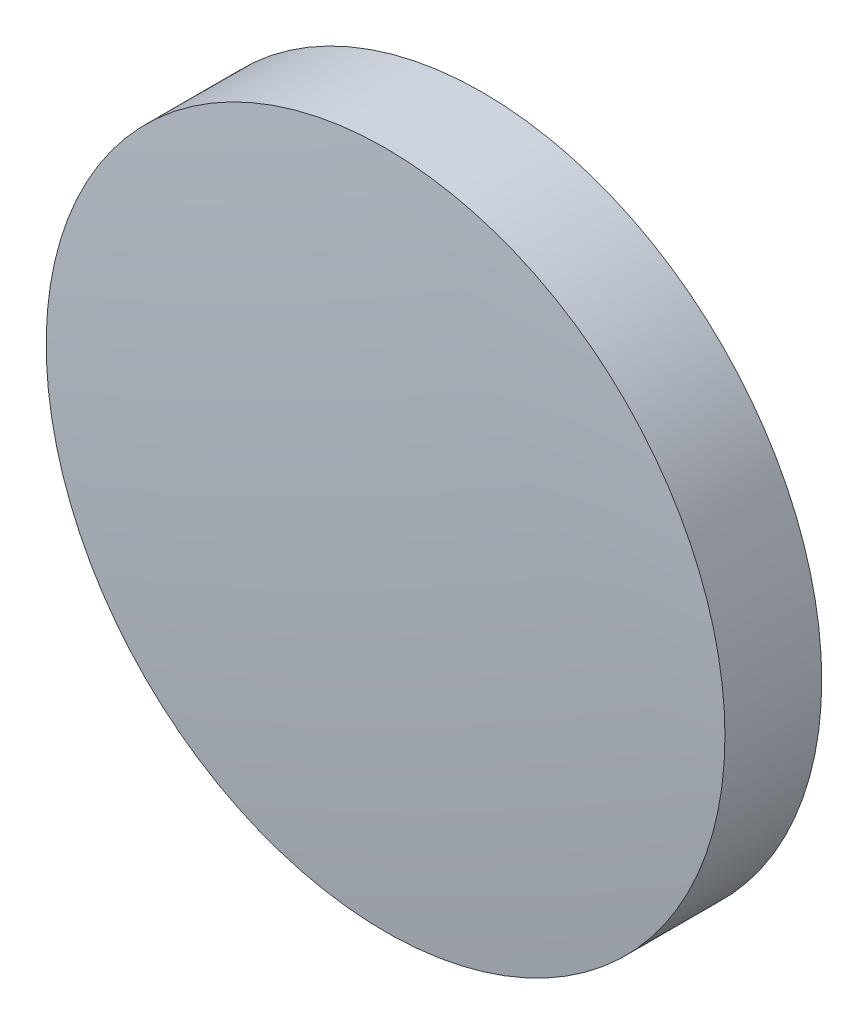
ISO-10303-21;
HEADER;
FILE_DESCRIPTION(('STEP AP214'),'2;1');
FILE_NAME('part.step','',(''),(''),'','','');
FILE_SCHEMA(('AUTOMOTIVE_DESIGN { 1 0 10303 214 1 1 1 1 }'));
ENDSEC;
DATA;
#1=APPLICATION_CONTEXT('core data for automotive mechanical design processes');
#2=APPLICATION_PROTOCOL_DEFINITION('international standard','automotive_design',2000,#1);
#3=PRODUCT_CONTEXT('',#1,'mechanical');
#4=PRODUCT('Part','Part','',(#3));
#5=PRODUCT_RELATED_PRODUCT_CATEGORY('part','',(#4));
#6=PRODUCT_DEFINITION_FORMATION('','',#4);
#7=PRODUCT_DEFINITION_CONTEXT('part definition',#1,'design');
#8=PRODUCT_DEFINITION('design','',#6,#7);
#9=PRODUCT_DEFINITION_SHAPE('','',#8);
#10=(LENGTH_UNIT() NAMED_UNIT(*) SI_UNIT(.MILLI.,.METRE.));
#11=(NAMED_UNIT(*) PLANE_ANGLE_UNIT() SI_UNIT($,.RADIAN.));
#12=(NAMED_UNIT(*) SI_UNIT($,.STERADIAN.) SOLID_ANGLE_UNIT());
#13=UNCERTAINTY_MEASURE_WITH_UNIT(LENGTH_MEASURE(1.E-05),#10,'distance_accuracy_value','');
#14=(GEOMETRIC_REPRESENTATION_CONTEXT(3) GLOBAL_UNCERTAINTY_ASSIGNED_CONTEXT((#13)) GLOBAL_UNIT_ASSIGNED_CONTEXT((#10,
#11,#12)) REPRESENTATION_CONTEXT('',''));
#15=CARTESIAN_POINT('',(0.,0.,0.));
#16=DIRECTION('',(0.,0.,1.));
#17=DIRECTION('',(1.,0.,0.));
#18=AXIS2_PLACEMENT_3D('',#15,#16,#17);
#19=CARTESIAN_POINT('',(0.,0.,-67.4));
#20=DIRECTION('',(0.,0.,1.));
#21=DIRECTION('',(0.,1.,0.));
#22=AXIS2_PLACEMENT_3D('',#19,#20,#21);
#23=SPHERICAL_SURFACE('',#22,68.6);
#24=CARTESIAN_POINT('',(0.,0.,0.905471962354534));
#25=DIRECTION('',(0.,0.,1.));
#26=DIRECTION('',(1.,0.,0.));
#27=AXIS2_PLACEMENT_3D('',#24,#25,#26);
#28=CIRCLE('',#27,6.35);
#29=CARTESIAN_POINT('',(6.35,0.,0.905471962354534));
#30=VERTEX_POINT('',#29);
#31=EDGE_CURVE('E10',#30,#30,#28,.T.);
#32=ORIENTED_EDGE('',*,*,#31,.T.);
#33=EDGE_LOOP('',(#32));
#34=FACE_BOUND('',#33,.T.);
#35=ADVANCED_FACE('F28',(#34),#23,.T.);
#36=CARTESIAN_POINT('',(0.,0.,1.2));
#37=DIRECTION('',(0.,0.,1.));
#38=DIRECTION('',(1.,0.,0.));
#39=AXIS2_PLACEMENT_3D('',#36,#37,#38);
#40=CYLINDRICAL_SURFACE('',#39,6.35);
#41=ORIENTED_EDGE('',*,*,#31,.F.);
#42=EDGE_LOOP('',(#41));
#43=FACE_BOUND('',#42,.T.);
#44=CARTESIAN_POINT('',(0.,0.,-0.905471962354534));
#45=DIRECTION('',(0.,0.,1.));
#46=DIRECTION('',(1.,0.,0.));
#47=AXIS2_PLACEMENT_3D('',#44,#45,#46);
#48=CIRCLE('',#47,6.35);
#49=CARTESIAN_POINT('',(6.35,0.,-0.905471962354534));
#50=VERTEX_POINT('',#49);
#51=EDGE_CURVE('E34',#50,#50,#48,.T.);
#52=ORIENTED_EDGE('',*,*,#51,.T.);
#53=EDGE_LOOP('',(#52));
#54=FACE_BOUND('',#53,.T.);
#55=ADVANCED_FACE('F40',(#43,#54),#40,.T.);
#56=CARTESIAN_POINT('',(0.,0.,67.4));
#57=DIRECTION('',(0.,0.,1.));
#58=DIRECTION('',(0.,1.,0.));
#59=AXIS2_PLACEMENT_3D('',#56,#57,#58);
#60=SPHERICAL_SURFACE('',#59,68.6);
#61=ORIENTED_EDGE('',*,*,#51,.F.);
#62=EDGE_LOOP('',(#61));
#63=FACE_BOUND('',#62,.T.);
#64=ADVANCED_FACE('F42',(#63),#60,.T.);
#65=CLOSED_SHELL('',(#35,#55,#64));
#66=MANIFOLD_SOLID_BREP('B2',#65);
#67=ADVANCED_BREP_SHAPE_REPRESENTATION('',(#18,#66),#14);
#68=SHAPE_DEFINITION_REPRESENTATION(#9,#67);
ENDSEC;
END-ISO-10303-21;
